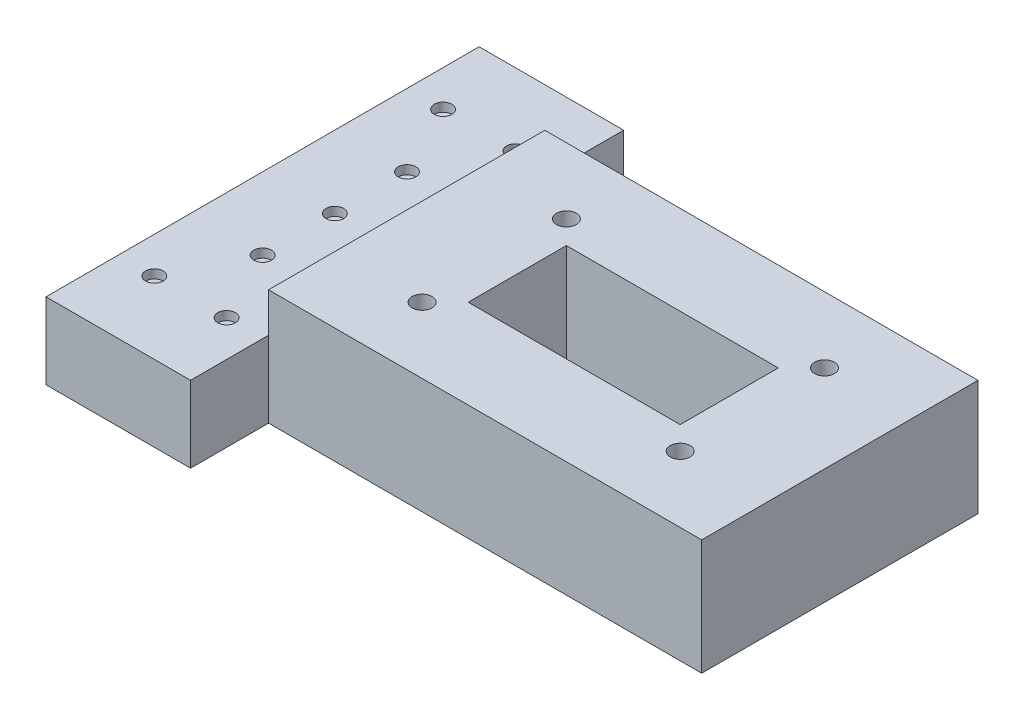
ISO-10303-21;
HEADER;
FILE_DESCRIPTION(('STEP AP214'),'2;1');
FILE_NAME('part.step','',(''),(''),'','','');
FILE_SCHEMA(('AUTOMOTIVE_DESIGN { 1 0 10303 214 1 1 1 1 }'));
ENDSEC;
DATA;
#1=APPLICATION_CONTEXT('core data for automotive mechanical design processes');
#2=APPLICATION_PROTOCOL_DEFINITION('international standard','automotive_design',2000,#1);
#3=PRODUCT_CONTEXT('',#1,'mechanical');
#4=PRODUCT('Part','Part','',(#3));
#5=PRODUCT_RELATED_PRODUCT_CATEGORY('part','',(#4));
#6=PRODUCT_DEFINITION_FORMATION('','',#4);
#7=PRODUCT_DEFINITION_CONTEXT('part definition',#1,'design');
#8=PRODUCT_DEFINITION('design','',#6,#7);
#9=PRODUCT_DEFINITION_SHAPE('','',#8);
#10=(LENGTH_UNIT() NAMED_UNIT(*) SI_UNIT(.MILLI.,.METRE.));
#11=(NAMED_UNIT(*) PLANE_ANGLE_UNIT() SI_UNIT($,.RADIAN.));
#12=(NAMED_UNIT(*) SI_UNIT($,.STERADIAN.) SOLID_ANGLE_UNIT());
#13=UNCERTAINTY_MEASURE_WITH_UNIT(LENGTH_MEASURE(1.E-05),#10,'distance_accuracy_value','');
#14=(GEOMETRIC_REPRESENTATION_CONTEXT(3) GLOBAL_UNCERTAINTY_ASSIGNED_CONTEXT((#13)) GLOBAL_UNIT_ASSIGNED_CONTEXT((#10,
#11,#12)) REPRESENTATION_CONTEXT('',''));
#15=CARTESIAN_POINT('',(0.,0.,0.));
#16=DIRECTION('',(0.,0.,1.));
#17=DIRECTION('',(1.,0.,0.));
#18=AXIS2_PLACEMENT_3D('',#15,#16,#17);
#19=CARTESIAN_POINT('',(-130.88,136.123620926388,0.));
#20=DIRECTION('',(1.,0.,0.));
#21=DIRECTION('',(0.,0.,-1.));
#22=AXIS2_PLACEMENT_3D('',#19,#20,#21);
#23=PLANE('',#22);
#24=DIRECTION('',(0.,0.,-1.));
#25=VECTOR('',#24,1.);
#26=CARTESIAN_POINT('',(-130.88,26.38,0.));
#27=LINE('',#26,#25);
#28=CARTESIAN_POINT('',(-130.88,26.38,10.));
#29=VERTEX_POINT('',#28);
#30=CARTESIAN_POINT('',(-130.88,26.38,-85.69));
#31=VERTEX_POINT('',#30);
#32=EDGE_CURVE('E11',#29,#31,#27,.T.);
#33=ORIENTED_EDGE('',*,*,#32,.F.);
#34=DIRECTION('',(0.,-1.,0.));
#35=VECTOR('',#34,1.);
#36=CARTESIAN_POINT('',(-130.88,136.123620926388,10.));
#37=LINE('',#36,#35);
#38=CARTESIAN_POINT('',(-130.88,40.,10.));
#39=VERTEX_POINT('',#38);
#40=EDGE_CURVE('E199',#39,#29,#37,.T.);
#41=ORIENTED_EDGE('',*,*,#40,.F.);
#42=DIRECTION('',(0.,0.,1.));
#43=VECTOR('',#42,1.);
#44=CARTESIAN_POINT('',(-130.88,40.,0.));
#45=LINE('',#44,#43);
#46=CARTESIAN_POINT('',(-130.88,40.,-85.69));
#47=VERTEX_POINT('',#46);
#48=EDGE_CURVE('E195',#47,#39,#45,.T.);
#49=ORIENTED_EDGE('',*,*,#48,.F.);
#50=DIRECTION('',(0.,-1.,0.));
#51=VECTOR('',#50,1.);
#52=CARTESIAN_POINT('',(-130.88,136.123620926388,-85.69));
#53=LINE('',#52,#51);
#54=EDGE_CURVE('E202',#47,#31,#53,.T.);
#55=ORIENTED_EDGE('',*,*,#54,.T.);
#56=EDGE_LOOP('',(#33,#41,#49,#55));
#57=FACE_BOUND('',#56,.T.);
#58=ADVANCED_FACE('F38',(#57),#23,.F.);
#59=CARTESIAN_POINT('',(-100.58,40.,-12.85));
#60=DIRECTION('',(0.,-1.,0.));
#61=DIRECTION('',(0.,0.,-1.));
#62=AXIS2_PLACEMENT_3D('',#59,#60,#61);
#63=CYLINDRICAL_SURFACE('',#62,3.43);
#64=CARTESIAN_POINT('',(-100.58,40.,-12.85));
#65=DIRECTION('',(0.,1.,0.));
#66=DIRECTION('',(0.,0.,1.));
#67=AXIS2_PLACEMENT_3D('',#64,#65,#66);
#68=CIRCLE('',#67,3.43);
#69=CARTESIAN_POINT('',(-100.58,40.,-9.41999999999997));
#70=VERTEX_POINT('',#69);
#71=EDGE_CURVE('E237',#70,#70,#68,.T.);
#72=ORIENTED_EDGE('',*,*,#71,.T.);
#73=EDGE_LOOP('',(#72));
#74=FACE_BOUND('',#73,.T.);
#75=CARTESIAN_POINT('',(-100.58,8.,-12.85));
#76=DIRECTION('',(0.,-1.,0.));
#77=DIRECTION('',(0.,0.,-1.));
#78=AXIS2_PLACEMENT_3D('',#75,#76,#77);
#79=CIRCLE('',#78,3.43);
#80=CARTESIAN_POINT('',(-100.58,8.,-16.28));
#81=VERTEX_POINT('',#80);
#82=EDGE_CURVE('E42',#81,#81,#79,.T.);
#83=ORIENTED_EDGE('',*,*,#82,.T.);
#84=EDGE_LOOP('',(#83));
#85=FACE_BOUND('',#84,.T.);
#86=ADVANCED_FACE('F287',(#74,#85),#63,.F.);
#87=CARTESIAN_POINT('',(-100.58,40.,-62.84));
#88=DIRECTION('',(0.,-1.,0.));
#89=DIRECTION('',(0.,0.,-1.));
#90=AXIS2_PLACEMENT_3D('',#87,#88,#89);
#91=CYLINDRICAL_SURFACE('',#90,3.43);
#92=CARTESIAN_POINT('',(-100.58,40.,-62.84));
#93=DIRECTION('',(0.,1.,0.));
#94=DIRECTION('',(0.,0.,1.));
#95=AXIS2_PLACEMENT_3D('',#92,#93,#94);
#96=CIRCLE('',#95,3.43);
#97=CARTESIAN_POINT('',(-100.58,40.,-59.41));
#98=VERTEX_POINT('',#97);
#99=EDGE_CURVE('E234',#98,#98,#96,.T.);
#100=ORIENTED_EDGE('',*,*,#99,.T.);
#101=EDGE_LOOP('',(#100));
#102=FACE_BOUND('',#101,.T.);
#103=CARTESIAN_POINT('',(-100.58,8.,-62.84));
#104=DIRECTION('',(0.,-1.,0.));
#105=DIRECTION('',(0.,0.,-1.));
#106=AXIS2_PLACEMENT_3D('',#103,#104,#105);
#107=CIRCLE('',#106,3.43);
#108=CARTESIAN_POINT('',(-100.58,8.,-66.27));
#109=VERTEX_POINT('',#108);
#110=EDGE_CURVE('E280',#109,#109,#107,.T.);
#111=ORIENTED_EDGE('',*,*,#110,.T.);
#112=EDGE_LOOP('',(#111));
#113=FACE_BOUND('',#112,.T.);
#114=ADVANCED_FACE('F344',(#102,#113),#91,.F.);
#115=CARTESIAN_POINT('',(-11.1800000000001,40.,-62.84));
#116=DIRECTION('',(0.,-1.,0.));
#117=DIRECTION('',(0.,0.,-1.));
#118=AXIS2_PLACEMENT_3D('',#115,#116,#117);
#119=CYLINDRICAL_SURFACE('',#118,3.43);
#120=CARTESIAN_POINT('',(-11.1800000000001,40.,-62.84));
#121=DIRECTION('',(0.,1.,0.));
#122=DIRECTION('',(0.,0.,1.));
#123=AXIS2_PLACEMENT_3D('',#120,#121,#122);
#124=CIRCLE('',#123,3.43);
#125=CARTESIAN_POINT('',(-11.1800000000001,40.,-59.41));
#126=VERTEX_POINT('',#125);
#127=EDGE_CURVE('E231',#126,#126,#124,.T.);
#128=ORIENTED_EDGE('',*,*,#127,.T.);
#129=EDGE_LOOP('',(#128));
#130=FACE_BOUND('',#129,.T.);
#131=CARTESIAN_POINT('',(-11.1800000000001,8.,-62.84));
#132=DIRECTION('',(0.,-1.,0.));
#133=DIRECTION('',(0.,0.,-1.));
#134=AXIS2_PLACEMENT_3D('',#131,#132,#133);
#135=CIRCLE('',#134,3.43);
#136=CARTESIAN_POINT('',(-11.1800000000001,8.,-66.27));
#137=VERTEX_POINT('',#136);
#138=EDGE_CURVE('E278',#137,#137,#135,.T.);
#139=ORIENTED_EDGE('',*,*,#138,.T.);
#140=EDGE_LOOP('',(#139));
#141=FACE_BOUND('',#140,.T.);
#142=ADVANCED_FACE('F375',(#130,#141),#119,.F.);
#143=CARTESIAN_POINT('',(-11.18,40.,-12.85));
#144=DIRECTION('',(0.,-1.,0.));
#145=DIRECTION('',(0.,0.,-1.));
#146=AXIS2_PLACEMENT_3D('',#143,#144,#145);
#147=CYLINDRICAL_SURFACE('',#146,3.43);
#148=CARTESIAN_POINT('',(-11.18,40.,-12.85));
#149=DIRECTION('',(0.,1.,0.));
#150=DIRECTION('',(0.,0.,1.));
#151=AXIS2_PLACEMENT_3D('',#148,#149,#150);
#152=CIRCLE('',#151,3.43);
#153=CARTESIAN_POINT('',(-11.18,40.,-9.41999999999998));
#154=VERTEX_POINT('',#153);
#155=EDGE_CURVE('E228',#154,#154,#152,.T.);
#156=ORIENTED_EDGE('',*,*,#155,.T.);
#157=EDGE_LOOP('',(#156));
#158=FACE_BOUND('',#157,.T.);
#159=CARTESIAN_POINT('',(-11.18,8.,-12.85));
#160=DIRECTION('',(0.,-1.,0.));
#161=DIRECTION('',(0.,0.,-1.));
#162=AXIS2_PLACEMENT_3D('',#159,#160,#161);
#163=CIRCLE('',#162,3.43);
#164=CARTESIAN_POINT('',(-11.18,8.,-16.28));
#165=VERTEX_POINT('',#164);
#166=EDGE_CURVE('E225',#165,#165,#163,.T.);
#167=ORIENTED_EDGE('',*,*,#166,.T.);
#168=EDGE_LOOP('',(#167));
#169=FACE_BOUND('',#168,.T.);
#170=ADVANCED_FACE('F372',(#158,#169),#147,.F.);
#171=CARTESIAN_POINT('',(0.,40.,0.));
#172=DIRECTION('',(0.,1.,0.));
#173=DIRECTION('',(0.,0.,1.));
#174=AXIS2_PLACEMENT_3D('',#171,#172,#173);
#175=PLANE('',#174);
#176=ORIENTED_EDGE('',*,*,#127,.F.);
#177=EDGE_LOOP('',(#176));
#178=FACE_BOUND('',#177,.T.);
#179=ORIENTED_EDGE('',*,*,#71,.F.);
#180=EDGE_LOOP('',(#179));
#181=FACE_BOUND('',#180,.T.);
#182=DIRECTION('',(-1.,0.,0.));
#183=VECTOR('',#182,1.);
#184=CARTESIAN_POINT('',(-121.76,40.,-85.69));
#185=LINE('',#184,#183);
#186=CARTESIAN_POINT('',(19.12,40.,-85.69));
#187=VERTEX_POINT('',#186);
#188=EDGE_CURVE('E47',#187,#47,#185,.T.);
#189=ORIENTED_EDGE('',*,*,#188,.T.);
#190=ORIENTED_EDGE('',*,*,#48,.T.);
#191=DIRECTION('',(1.,0.,0.));
#192=VECTOR('',#191,1.);
#193=CARTESIAN_POINT('',(-121.76,40.,10.));
#194=LINE('',#193,#192);
#195=CARTESIAN_POINT('',(19.12,40.,10.));
#196=VERTEX_POINT('',#195);
#197=EDGE_CURVE('E270',#39,#196,#194,.T.);
#198=ORIENTED_EDGE('',*,*,#197,.T.);
#199=DIRECTION('',(0.,0.,-1.));
#200=VECTOR('',#199,1.);
#201=CARTESIAN_POINT('',(19.12,40.,0.));
#202=LINE('',#201,#200);
#203=EDGE_CURVE('E186',#196,#187,#202,.T.);
#204=ORIENTED_EDGE('',*,*,#203,.T.);
#205=EDGE_LOOP('',(#189,#190,#198,#204));
#206=FACE_BOUND('',#205,.T.);
#207=DIRECTION('',(1.,0.,0.));
#208=VECTOR('',#207,1.);
#209=CARTESIAN_POINT('',(-92.58,40.,-20.85));
#210=LINE('',#209,#208);
#211=CARTESIAN_POINT('',(-92.58,40.,-20.85));
#212=VERTEX_POINT('',#211);
#213=CARTESIAN_POINT('',(-19.18,40.,-20.85));
#214=VERTEX_POINT('',#213);
#215=EDGE_CURVE('E243',#212,#214,#210,.T.);
#216=ORIENTED_EDGE('',*,*,#215,.F.);
#217=DIRECTION('',(0.,0.,1.));
#218=VECTOR('',#217,1.);
#219=CARTESIAN_POINT('',(-92.58,40.,-20.85));
#220=LINE('',#219,#218);
#221=CARTESIAN_POINT('',(-92.58,40.,-54.84));
#222=VERTEX_POINT('',#221);
#223=EDGE_CURVE('E241',#222,#212,#220,.T.);
#224=ORIENTED_EDGE('',*,*,#223,.F.);
#225=DIRECTION('',(-1.,0.,0.));
#226=VECTOR('',#225,1.);
#227=CARTESIAN_POINT('',(-92.58,40.,-54.84));
#228=LINE('',#227,#226);
#229=CARTESIAN_POINT('',(-19.18,40.,-54.84));
#230=VERTEX_POINT('',#229);
#231=EDGE_CURVE('E248',#230,#222,#228,.T.);
#232=ORIENTED_EDGE('',*,*,#231,.F.);
#233=DIRECTION('',(0.,0.,-1.));
#234=VECTOR('',#233,1.);
#235=CARTESIAN_POINT('',(-19.18,40.,-20.85));
#236=LINE('',#235,#234);
#237=EDGE_CURVE('E246',#214,#230,#236,.T.);
#238=ORIENTED_EDGE('',*,*,#237,.F.);
#239=EDGE_LOOP('',(#216,#224,#232,#238));
#240=FACE_BOUND('',#239,.T.);
#241=ORIENTED_EDGE('',*,*,#99,.F.);
#242=EDGE_LOOP('',(#241));
#243=FACE_BOUND('',#242,.T.);
#244=ORIENTED_EDGE('',*,*,#155,.F.);
#245=EDGE_LOOP('',(#244));
#246=FACE_BOUND('',#245,.T.);
#247=ADVANCED_FACE('F306',(#178,#181,#206,#240,#243,#246),#175,.T.);
#248=CARTESIAN_POINT('',(0.,0.,0.));
#249=DIRECTION('',(0.,1.,0.));
#250=DIRECTION('',(0.,0.,1.));
#251=AXIS2_PLACEMENT_3D('',#248,#249,#250);
#252=PLANE('',#251);
#253=CARTESIAN_POINT('',(-100.58,0.,-62.84));
#254=DIRECTION('',(0.,-1.,0.));
#255=DIRECTION('',(0.,0.,-1.));
#256=AXIS2_PLACEMENT_3D('',#253,#254,#255);
#257=CIRCLE('',#256,8.00000000000006);
#258=CARTESIAN_POINT('',(-100.58,0.,-70.8400000000001));
#259=VERTEX_POINT('',#258);
#260=EDGE_CURVE('E198',#259,#259,#257,.T.);
#261=ORIENTED_EDGE('',*,*,#260,.F.);
#262=EDGE_LOOP('',(#261));
#263=FACE_BOUND('',#262,.T.);
#264=CARTESIAN_POINT('',(-11.1800000000001,0.,-62.84));
#265=DIRECTION('',(0.,-1.,0.));
#266=DIRECTION('',(0.,0.,-1.));
#267=AXIS2_PLACEMENT_3D('',#264,#265,#266);
#268=CIRCLE('',#267,7.99999999999995);
#269=CARTESIAN_POINT('',(-11.1800000000001,0.,-70.84));
#270=VERTEX_POINT('',#269);
#271=EDGE_CURVE('E214',#270,#270,#268,.T.);
#272=ORIENTED_EDGE('',*,*,#271,.F.);
#273=EDGE_LOOP('',(#272));
#274=FACE_BOUND('',#273,.T.);
#275=CARTESIAN_POINT('',(-11.18,0.,-12.85));
#276=DIRECTION('',(0.,-1.,0.));
#277=DIRECTION('',(0.,0.,-1.));
#278=AXIS2_PLACEMENT_3D('',#275,#276,#277);
#279=CIRCLE('',#278,8.00000000000002);
#280=CARTESIAN_POINT('',(-11.18,0.,-20.85));
#281=VERTEX_POINT('',#280);
#282=EDGE_CURVE('E208',#281,#281,#279,.T.);
#283=ORIENTED_EDGE('',*,*,#282,.F.);
#284=EDGE_LOOP('',(#283));
#285=FACE_BOUND('',#284,.T.);
#286=CARTESIAN_POINT('',(-100.58,0.,-12.85));
#287=DIRECTION('',(0.,-1.,0.));
#288=DIRECTION('',(0.,0.,-1.));
#289=AXIS2_PLACEMENT_3D('',#286,#287,#288);
#290=CIRCLE('',#289,8.00000000000001);
#291=CARTESIAN_POINT('',(-100.58,0.,-20.85));
#292=VERTEX_POINT('',#291);
#293=EDGE_CURVE('E207',#292,#292,#290,.T.);
#294=ORIENTED_EDGE('',*,*,#293,.F.);
#295=EDGE_LOOP('',(#294));
#296=FACE_BOUND('',#295,.T.);
#297=DIRECTION('',(1.,0.,0.));
#298=VECTOR('',#297,1.);
#299=CARTESIAN_POINT('',(-121.76,0.,10.));
#300=LINE('',#299,#298);
#301=CARTESIAN_POINT('',(-130.88,0.,10.));
#302=VERTEX_POINT('',#301);
#303=CARTESIAN_POINT('',(19.12,0.,10.));
#304=VERTEX_POINT('',#303);
#305=EDGE_CURVE('E269',#302,#304,#300,.T.);
#306=ORIENTED_EDGE('',*,*,#305,.F.);
#307=DIRECTION('',(0.,0.,-1.));
#308=VECTOR('',#307,1.);
#309=CARTESIAN_POINT('',(-130.88,0.,0.));
#310=LINE('',#309,#308);
#311=CARTESIAN_POINT('',(-130.88,0.,37.02));
#312=VERTEX_POINT('',#311);
#313=EDGE_CURVE('E160',#312,#302,#310,.T.);
#314=ORIENTED_EDGE('',*,*,#313,.F.);
#315=DIRECTION('',(-1.,0.,0.));
#316=VECTOR('',#315,1.);
#317=CARTESIAN_POINT('',(0.,0.,37.02));
#318=LINE('',#317,#316);
#319=CARTESIAN_POINT('',(-180.93,0.,37.02));
#320=VERTEX_POINT('',#319);
#321=EDGE_CURVE('E170',#312,#320,#318,.T.);
#322=ORIENTED_EDGE('',*,*,#321,.T.);
#323=DIRECTION('',(0.,0.,-1.));
#324=VECTOR('',#323,1.);
#325=CARTESIAN_POINT('',(-180.93,0.,0.));
#326=LINE('',#325,#324);
#327=CARTESIAN_POINT('',(-180.93,0.,-112.98));
#328=VERTEX_POINT('',#327);
#329=EDGE_CURVE('E141',#320,#328,#326,.T.);
#330=ORIENTED_EDGE('',*,*,#329,.T.);
#331=DIRECTION('',(-1.,0.,0.));
#332=VECTOR('',#331,1.);
#333=CARTESIAN_POINT('',(0.,0.,-112.98));
#334=LINE('',#333,#332);
#335=CARTESIAN_POINT('',(-130.88,0.,-112.98));
#336=VERTEX_POINT('',#335);
#337=EDGE_CURVE('E174',#336,#328,#334,.T.);
#338=ORIENTED_EDGE('',*,*,#337,.F.);
#339=CARTESIAN_POINT('',(-130.88,0.,-85.69));
#340=VERTEX_POINT('',#339);
#341=EDGE_CURVE('E163',#340,#336,#310,.T.);
#342=ORIENTED_EDGE('',*,*,#341,.F.);
#343=DIRECTION('',(-1.,0.,0.));
#344=VECTOR('',#343,1.);
#345=CARTESIAN_POINT('',(-121.76,0.,-85.69));
#346=LINE('',#345,#344);
#347=CARTESIAN_POINT('',(19.12,0.,-85.69));
#348=VERTEX_POINT('',#347);
#349=EDGE_CURVE('E272',#348,#340,#346,.T.);
#350=ORIENTED_EDGE('',*,*,#349,.F.);
#351=DIRECTION('',(0.,0.,-1.));
#352=VECTOR('',#351,1.);
#353=CARTESIAN_POINT('',(19.12,0.,0.));
#354=LINE('',#353,#352);
#355=EDGE_CURVE('E183',#304,#348,#354,.T.);
#356=ORIENTED_EDGE('',*,*,#355,.F.);
#357=EDGE_LOOP('',(#306,#314,#322,#330,#338,#342,#350,#356));
#358=FACE_BOUND('',#357,.T.);
#359=DIRECTION('',(0.,0.,1.));
#360=VECTOR('',#359,1.);
#361=CARTESIAN_POINT('',(-92.58,0.,-20.85));
#362=LINE('',#361,#360);
#363=CARTESIAN_POINT('',(-92.58,0.,-54.84));
#364=VERTEX_POINT('',#363);
#365=CARTESIAN_POINT('',(-92.58,0.,-20.85));
#366=VERTEX_POINT('',#365);
#367=EDGE_CURVE('E240',#364,#366,#362,.T.);
#368=ORIENTED_EDGE('',*,*,#367,.T.);
#369=DIRECTION('',(1.,0.,0.));
#370=VECTOR('',#369,1.);
#371=CARTESIAN_POINT('',(-92.58,0.,-20.85));
#372=LINE('',#371,#370);
#373=CARTESIAN_POINT('',(-19.18,0.,-20.85));
#374=VERTEX_POINT('',#373);
#375=EDGE_CURVE('E253',#366,#374,#372,.T.);
#376=ORIENTED_EDGE('',*,*,#375,.T.);
#377=DIRECTION('',(0.,0.,-1.));
#378=VECTOR('',#377,1.);
#379=CARTESIAN_POINT('',(-19.18,0.,-20.85));
#380=LINE('',#379,#378);
#381=CARTESIAN_POINT('',(-19.18,0.,-54.84));
#382=VERTEX_POINT('',#381);
#383=EDGE_CURVE('E256',#374,#382,#380,.T.);
#384=ORIENTED_EDGE('',*,*,#383,.T.);
#385=DIRECTION('',(-1.,0.,0.));
#386=VECTOR('',#385,1.);
#387=CARTESIAN_POINT('',(-92.58,0.,-54.84));
#388=LINE('',#387,#386);
#389=EDGE_CURVE('E244',#382,#364,#388,.T.);
#390=ORIENTED_EDGE('',*,*,#389,.T.);
#391=EDGE_LOOP('',(#368,#376,#384,#390));
#392=FACE_BOUND('',#391,.T.);
#393=ADVANCED_FACE('F303',(#263,#274,#285,#296,#358,#392),#252,.F.);
#394=CARTESIAN_POINT('',(-121.76,40.,10.));
#395=DIRECTION('',(0.,0.,-1.));
#396=DIRECTION('',(-1.,0.,0.));
#397=AXIS2_PLACEMENT_3D('',#394,#395,#396);
#398=PLANE('',#397);
#399=ORIENTED_EDGE('',*,*,#305,.T.);
#400=DIRECTION('',(0.,-1.,0.));
#401=VECTOR('',#400,1.);
#402=CARTESIAN_POINT('',(19.12,136.123620926388,10.));
#403=LINE('',#402,#401);
#404=EDGE_CURVE('E187',#196,#304,#403,.T.);
#405=ORIENTED_EDGE('',*,*,#404,.F.);
#406=ORIENTED_EDGE('',*,*,#197,.F.);
#407=ORIENTED_EDGE('',*,*,#40,.T.);
#408=EDGE_CURVE('E201',#29,#302,#37,.T.);
#409=ORIENTED_EDGE('',*,*,#408,.T.);
#410=EDGE_LOOP('',(#399,#405,#406,#407,#409));
#411=FACE_BOUND('',#410,.T.);
#412=ADVANCED_FACE('F40',(#411),#398,.F.);
#413=CARTESIAN_POINT('',(-121.76,40.,-85.69));
#414=DIRECTION('',(0.,0.,1.));
#415=DIRECTION('',(1.,0.,0.));
#416=AXIS2_PLACEMENT_3D('',#413,#414,#415);
#417=PLANE('',#416);
#418=ORIENTED_EDGE('',*,*,#349,.T.);
#419=EDGE_CURVE('E190',#31,#340,#53,.T.);
#420=ORIENTED_EDGE('',*,*,#419,.F.);
#421=ORIENTED_EDGE('',*,*,#54,.F.);
#422=ORIENTED_EDGE('',*,*,#188,.F.);
#423=DIRECTION('',(0.,-1.,0.));
#424=VECTOR('',#423,1.);
#425=CARTESIAN_POINT('',(19.12,136.123620926388,-85.69));
#426=LINE('',#425,#424);
#427=EDGE_CURVE('E178',#187,#348,#426,.T.);
#428=ORIENTED_EDGE('',*,*,#427,.T.);
#429=EDGE_LOOP('',(#418,#420,#421,#422,#428));
#430=FACE_BOUND('',#429,.T.);
#431=ADVANCED_FACE('F402',(#430),#417,.F.);
#432=CARTESIAN_POINT('',(-92.58,40.,-20.85));
#433=DIRECTION('',(1.,0.,0.));
#434=DIRECTION('',(0.,0.,-1.));
#435=AXIS2_PLACEMENT_3D('',#432,#433,#434);
#436=PLANE('',#435);
#437=ORIENTED_EDGE('',*,*,#367,.F.);
#438=DIRECTION('',(0.,-1.,0.));
#439=VECTOR('',#438,1.);
#440=CARTESIAN_POINT('',(-92.58,40.,-54.84));
#441=LINE('',#440,#439);
#442=EDGE_CURVE('E250',#222,#364,#441,.T.);
#443=ORIENTED_EDGE('',*,*,#442,.F.);
#444=ORIENTED_EDGE('',*,*,#223,.T.);
#445=DIRECTION('',(0.,-1.,0.));
#446=VECTOR('',#445,1.);
#447=CARTESIAN_POINT('',(-92.58,40.,-20.85));
#448=LINE('',#447,#446);
#449=EDGE_CURVE('E266',#212,#366,#448,.T.);
#450=ORIENTED_EDGE('',*,*,#449,.T.);
#451=EDGE_LOOP('',(#437,#443,#444,#450));
#452=FACE_BOUND('',#451,.T.);
#453=ADVANCED_FACE('F315',(#452),#436,.T.);
#454=CARTESIAN_POINT('',(-92.58,40.,-20.85));
#455=DIRECTION('',(0.,0.,-1.));
#456=DIRECTION('',(-1.,0.,0.));
#457=AXIS2_PLACEMENT_3D('',#454,#455,#456);
#458=PLANE('',#457);
#459=ORIENTED_EDGE('',*,*,#375,.F.);
#460=ORIENTED_EDGE('',*,*,#449,.F.);
#461=ORIENTED_EDGE('',*,*,#215,.T.);
#462=DIRECTION('',(0.,-1.,0.));
#463=VECTOR('',#462,1.);
#464=CARTESIAN_POINT('',(-19.18,40.,-20.85));
#465=LINE('',#464,#463);
#466=EDGE_CURVE('E264',#214,#374,#465,.T.);
#467=ORIENTED_EDGE('',*,*,#466,.T.);
#468=EDGE_LOOP('',(#459,#460,#461,#467));
#469=FACE_BOUND('',#468,.T.);
#470=ADVANCED_FACE('F325',(#469),#458,.T.);
#471=CARTESIAN_POINT('',(-19.18,40.,-20.85));
#472=DIRECTION('',(-1.,0.,0.));
#473=DIRECTION('',(0.,0.,1.));
#474=AXIS2_PLACEMENT_3D('',#471,#472,#473);
#475=PLANE('',#474);
#476=ORIENTED_EDGE('',*,*,#383,.F.);
#477=ORIENTED_EDGE('',*,*,#466,.F.);
#478=ORIENTED_EDGE('',*,*,#237,.T.);
#479=DIRECTION('',(0.,-1.,0.));
#480=VECTOR('',#479,1.);
#481=CARTESIAN_POINT('',(-19.18,40.,-54.84));
#482=LINE('',#481,#480);
#483=EDGE_CURVE('E63',#230,#382,#482,.T.);
#484=ORIENTED_EDGE('',*,*,#483,.T.);
#485=EDGE_LOOP('',(#476,#477,#478,#484));
#486=FACE_BOUND('',#485,.T.);
#487=ADVANCED_FACE('F329',(#486),#475,.T.);
#488=CARTESIAN_POINT('',(-92.58,40.,-54.84));
#489=DIRECTION('',(0.,0.,1.));
#490=DIRECTION('',(1.,0.,0.));
#491=AXIS2_PLACEMENT_3D('',#488,#489,#490);
#492=PLANE('',#491);
#493=ORIENTED_EDGE('',*,*,#389,.F.);
#494=ORIENTED_EDGE('',*,*,#483,.F.);
#495=ORIENTED_EDGE('',*,*,#231,.T.);
#496=ORIENTED_EDGE('',*,*,#442,.T.);
#497=EDGE_LOOP('',(#493,#494,#495,#496));
#498=FACE_BOUND('',#497,.T.);
#499=ADVANCED_FACE('F318',(#498),#492,.T.);
#500=CARTESIAN_POINT('',(-11.18,8.,-12.85));
#501=DIRECTION('',(0.,-1.,0.));
#502=DIRECTION('',(0.,0.,-1.));
#503=AXIS2_PLACEMENT_3D('',#500,#501,#502);
#504=CYLINDRICAL_SURFACE('',#503,8.00000000000002);
#505=CARTESIAN_POINT('',(-11.18,8.,-12.85));
#506=DIRECTION('',(0.,-1.,0.));
#507=DIRECTION('',(0.,0.,-1.));
#508=AXIS2_PLACEMENT_3D('',#505,#506,#507);
#509=CIRCLE('',#508,8.00000000000002);
#510=CARTESIAN_POINT('',(-11.18,8.,-20.85));
#511=VERTEX_POINT('',#510);
#512=EDGE_CURVE('E204',#511,#511,#509,.T.);
#513=ORIENTED_EDGE('',*,*,#512,.F.);
#514=EDGE_LOOP('',(#513));
#515=FACE_BOUND('',#514,.T.);
#516=ORIENTED_EDGE('',*,*,#282,.T.);
#517=EDGE_LOOP('',(#516));
#518=FACE_BOUND('',#517,.T.);
#519=ADVANCED_FACE('F336',(#515,#518),#504,.F.);
#520=CARTESIAN_POINT('',(-11.18,8.,-12.85));
#521=DIRECTION('',(0.,-1.,0.));
#522=DIRECTION('',(0.,0.,-1.));
#523=AXIS2_PLACEMENT_3D('',#520,#521,#522);
#524=PLANE('',#523);
#525=ORIENTED_EDGE('',*,*,#166,.F.);
#526=EDGE_LOOP('',(#525));
#527=FACE_BOUND('',#526,.T.);
#528=ORIENTED_EDGE('',*,*,#512,.T.);
#529=EDGE_LOOP('',(#528));
#530=FACE_BOUND('',#529,.T.);
#531=ADVANCED_FACE('F350',(#527,#530),#524,.T.);
#532=CARTESIAN_POINT('',(-11.1800000000001,8.,-62.84));
#533=DIRECTION('',(0.,-1.,0.));
#534=DIRECTION('',(0.,0.,-1.));
#535=AXIS2_PLACEMENT_3D('',#532,#533,#534);
#536=CYLINDRICAL_SURFACE('',#535,7.99999999999995);
#537=CARTESIAN_POINT('',(-11.1800000000001,8.,-62.84));
#538=DIRECTION('',(0.,-1.,0.));
#539=DIRECTION('',(0.,0.,-1.));
#540=AXIS2_PLACEMENT_3D('',#537,#538,#539);
#541=CIRCLE('',#540,7.99999999999995);
#542=CARTESIAN_POINT('',(-11.1800000000001,8.,-70.84));
#543=VERTEX_POINT('',#542);
#544=EDGE_CURVE('E211',#543,#543,#541,.T.);
#545=ORIENTED_EDGE('',*,*,#544,.F.);
#546=EDGE_LOOP('',(#545));
#547=FACE_BOUND('',#546,.T.);
#548=ORIENTED_EDGE('',*,*,#271,.T.);
#549=EDGE_LOOP('',(#548));
#550=FACE_BOUND('',#549,.T.);
#551=ADVANCED_FACE('F353',(#547,#550),#536,.F.);
#552=CARTESIAN_POINT('',(-11.1800000000001,8.,-62.84));
#553=DIRECTION('',(0.,-1.,0.));
#554=DIRECTION('',(0.,0.,-1.));
#555=AXIS2_PLACEMENT_3D('',#552,#553,#554);
#556=PLANE('',#555);
#557=ORIENTED_EDGE('',*,*,#138,.F.);
#558=EDGE_LOOP('',(#557));
#559=FACE_BOUND('',#558,.T.);
#560=ORIENTED_EDGE('',*,*,#544,.T.);
#561=EDGE_LOOP('',(#560));
#562=FACE_BOUND('',#561,.T.);
#563=ADVANCED_FACE('F358',(#559,#562),#556,.T.);
#564=CARTESIAN_POINT('',(-100.58,8.,-62.84));
#565=DIRECTION('',(0.,-1.,0.));
#566=DIRECTION('',(0.,0.,-1.));
#567=AXIS2_PLACEMENT_3D('',#564,#565,#566);
#568=CYLINDRICAL_SURFACE('',#567,8.00000000000006);
#569=CARTESIAN_POINT('',(-100.58,8.,-62.84));
#570=DIRECTION('',(0.,-1.,0.));
#571=DIRECTION('',(0.,0.,-1.));
#572=AXIS2_PLACEMENT_3D('',#569,#570,#571);
#573=CIRCLE('',#572,8.00000000000006);
#574=CARTESIAN_POINT('',(-100.58,8.,-70.8400000000001));
#575=VERTEX_POINT('',#574);
#576=EDGE_CURVE('E217',#575,#575,#573,.T.);
#577=ORIENTED_EDGE('',*,*,#576,.F.);
#578=EDGE_LOOP('',(#577));
#579=FACE_BOUND('',#578,.T.);
#580=ORIENTED_EDGE('',*,*,#260,.T.);
#581=EDGE_LOOP('',(#580));
#582=FACE_BOUND('',#581,.T.);
#583=ADVANCED_FACE('F361',(#579,#582),#568,.F.);
#584=CARTESIAN_POINT('',(-100.58,8.,-62.84));
#585=DIRECTION('',(0.,-1.,0.));
#586=DIRECTION('',(0.,0.,-1.));
#587=AXIS2_PLACEMENT_3D('',#584,#585,#586);
#588=PLANE('',#587);
#589=ORIENTED_EDGE('',*,*,#110,.F.);
#590=EDGE_LOOP('',(#589));
#591=FACE_BOUND('',#590,.T.);
#592=ORIENTED_EDGE('',*,*,#576,.T.);
#593=EDGE_LOOP('',(#592));
#594=FACE_BOUND('',#593,.T.);
#595=ADVANCED_FACE('F299',(#591,#594),#588,.T.);
#596=CARTESIAN_POINT('',(-100.58,8.,-12.85));
#597=DIRECTION('',(0.,-1.,0.));
#598=DIRECTION('',(0.,0.,-1.));
#599=AXIS2_PLACEMENT_3D('',#596,#597,#598);
#600=CYLINDRICAL_SURFACE('',#599,8.00000000000001);
#601=CARTESIAN_POINT('',(-100.58,8.,-12.85));
#602=DIRECTION('',(0.,-1.,0.));
#603=DIRECTION('',(0.,0.,-1.));
#604=AXIS2_PLACEMENT_3D('',#601,#602,#603);
#605=CIRCLE('',#604,8.00000000000001);
#606=CARTESIAN_POINT('',(-100.58,8.,-20.85));
#607=VERTEX_POINT('',#606);
#608=EDGE_CURVE('E222',#607,#607,#605,.T.);
#609=ORIENTED_EDGE('',*,*,#608,.F.);
#610=EDGE_LOOP('',(#609));
#611=FACE_BOUND('',#610,.T.);
#612=ORIENTED_EDGE('',*,*,#293,.T.);
#613=EDGE_LOOP('',(#612));
#614=FACE_BOUND('',#613,.T.);
#615=ADVANCED_FACE('F293',(#611,#614),#600,.F.);
#616=CARTESIAN_POINT('',(-100.58,8.,-12.85));
#617=DIRECTION('',(0.,-1.,0.));
#618=DIRECTION('',(0.,0.,-1.));
#619=AXIS2_PLACEMENT_3D('',#616,#617,#618);
#620=PLANE('',#619);
#621=ORIENTED_EDGE('',*,*,#82,.F.);
#622=EDGE_LOOP('',(#621));
#623=FACE_BOUND('',#622,.T.);
#624=ORIENTED_EDGE('',*,*,#608,.T.);
#625=EDGE_LOOP('',(#624));
#626=FACE_BOUND('',#625,.T.);
#627=ADVANCED_FACE('F289',(#623,#626),#620,.T.);
#628=CARTESIAN_POINT('',(19.12,136.123620926388,0.));
#629=DIRECTION('',(-1.,0.,0.));
#630=DIRECTION('',(0.,0.,1.));
#631=AXIS2_PLACEMENT_3D('',#628,#629,#630);
#632=PLANE('',#631);
#633=ORIENTED_EDGE('',*,*,#203,.F.);
#634=ORIENTED_EDGE('',*,*,#404,.T.);
#635=ORIENTED_EDGE('',*,*,#355,.T.);
#636=ORIENTED_EDGE('',*,*,#427,.F.);
#637=EDGE_LOOP('',(#633,#634,#635,#636));
#638=FACE_BOUND('',#637,.T.);
#639=ADVANCED_FACE('F292',(#638),#632,.F.);
#640=CARTESIAN_POINT('',(-130.88,26.38,0.));
#641=DIRECTION('',(-1.,0.,0.));
#642=DIRECTION('',(0.,0.,1.));
#643=AXIS2_PLACEMENT_3D('',#640,#641,#642);
#644=PLANE('',#643);
#645=CARTESIAN_POINT('',(-130.88,26.38,-112.98));
#646=VERTEX_POINT('',#645);
#647=EDGE_CURVE('E50',#31,#646,#27,.T.);
#648=ORIENTED_EDGE('',*,*,#647,.F.);
#649=ORIENTED_EDGE('',*,*,#419,.T.);
#650=ORIENTED_EDGE('',*,*,#341,.T.);
#651=DIRECTION('',(0.,-1.,0.));
#652=VECTOR('',#651,1.);
#653=CARTESIAN_POINT('',(-130.88,26.38,-112.98));
#654=LINE('',#653,#652);
#655=EDGE_CURVE('E179',#646,#336,#654,.T.);
#656=ORIENTED_EDGE('',*,*,#655,.F.);
#657=EDGE_LOOP('',(#648,#649,#650,#656));
#658=FACE_BOUND('',#657,.T.);
#659=ADVANCED_FACE('F417',(#658),#644,.F.);
#660=CARTESIAN_POINT('',(0.,26.38,37.02));
#661=DIRECTION('',(0.,0.,1.));
#662=DIRECTION('',(1.,0.,0.));
#663=AXIS2_PLACEMENT_3D('',#660,#661,#662);
#664=PLANE('',#663);
#665=ORIENTED_EDGE('',*,*,#321,.F.);
#666=DIRECTION('',(0.,-1.,0.));
#667=VECTOR('',#666,1.);
#668=CARTESIAN_POINT('',(-130.88,26.38,37.02));
#669=LINE('',#668,#667);
#670=CARTESIAN_POINT('',(-130.88,26.38,37.02));
#671=VERTEX_POINT('',#670);
#672=EDGE_CURVE('E158',#671,#312,#669,.T.);
#673=ORIENTED_EDGE('',*,*,#672,.F.);
#674=DIRECTION('',(-1.,0.,0.));
#675=VECTOR('',#674,1.);
#676=CARTESIAN_POINT('',(0.,26.38,37.02));
#677=LINE('',#676,#675);
#678=CARTESIAN_POINT('',(-180.93,26.38,37.02));
#679=VERTEX_POINT('',#678);
#680=EDGE_CURVE('E152',#671,#679,#677,.T.);
#681=ORIENTED_EDGE('',*,*,#680,.T.);
#682=DIRECTION('',(0.,-1.,0.));
#683=VECTOR('',#682,1.);
#684=CARTESIAN_POINT('',(-180.93,26.38,37.02));
#685=LINE('',#684,#683);
#686=EDGE_CURVE('E136',#679,#320,#685,.T.);
#687=ORIENTED_EDGE('',*,*,#686,.T.);
#688=EDGE_LOOP('',(#665,#673,#681,#687));
#689=FACE_BOUND('',#688,.T.);
#690=ADVANCED_FACE('F157',(#689),#664,.T.);
#691=ORIENTED_EDGE('',*,*,#408,.F.);
#692=EDGE_CURVE('E49',#671,#29,#27,.T.);
#693=ORIENTED_EDGE('',*,*,#692,.F.);
#694=ORIENTED_EDGE('',*,*,#672,.T.);
#695=ORIENTED_EDGE('',*,*,#313,.T.);
#696=EDGE_LOOP('',(#691,#693,#694,#695));
#697=FACE_BOUND('',#696,.T.);
#698=ADVANCED_FACE('F423',(#697),#644,.F.);
#699=CARTESIAN_POINT('',(0.,26.38,-112.98));
#700=DIRECTION('',(0.,0.,1.));
#701=DIRECTION('',(1.,0.,0.));
#702=AXIS2_PLACEMENT_3D('',#699,#700,#701);
#703=PLANE('',#702);
#704=ORIENTED_EDGE('',*,*,#337,.T.);
#705=DIRECTION('',(0.,-1.,0.));
#706=VECTOR('',#705,1.);
#707=CARTESIAN_POINT('',(-180.93,26.38,-112.98));
#708=LINE('',#707,#706);
#709=CARTESIAN_POINT('',(-180.93,26.38,-112.98));
#710=VERTEX_POINT('',#709);
#711=EDGE_CURVE('E146',#710,#328,#708,.T.);
#712=ORIENTED_EDGE('',*,*,#711,.F.);
#713=DIRECTION('',(-1.,0.,0.));
#714=VECTOR('',#713,1.);
#715=CARTESIAN_POINT('',(0.,26.38,-112.98));
#716=LINE('',#715,#714);
#717=EDGE_CURVE('E154',#646,#710,#716,.T.);
#718=ORIENTED_EDGE('',*,*,#717,.F.);
#719=ORIENTED_EDGE('',*,*,#655,.T.);
#720=EDGE_LOOP('',(#704,#712,#718,#719));
#721=FACE_BOUND('',#720,.T.);
#722=ADVANCED_FACE('F421',(#721),#703,.F.);
#723=CARTESIAN_POINT('',(-180.93,26.38,0.));
#724=DIRECTION('',(-1.,0.,0.));
#725=DIRECTION('',(0.,0.,1.));
#726=AXIS2_PLACEMENT_3D('',#723,#724,#725);
#727=PLANE('',#726);
#728=ORIENTED_EDGE('',*,*,#329,.F.);
#729=ORIENTED_EDGE('',*,*,#686,.F.);
#730=DIRECTION('',(0.,0.,-1.));
#731=VECTOR('',#730,1.);
#732=CARTESIAN_POINT('',(-180.93,26.38,0.));
#733=LINE('',#732,#731);
#734=EDGE_CURVE('E139',#679,#710,#733,.T.);
#735=ORIENTED_EDGE('',*,*,#734,.T.);
#736=ORIENTED_EDGE('',*,*,#711,.T.);
#737=EDGE_LOOP('',(#728,#729,#735,#736));
#738=FACE_BOUND('',#737,.T.);
#739=ADVANCED_FACE('F138',(#738),#727,.T.);
#740=CARTESIAN_POINT('',(0.,26.38,0.));
#741=DIRECTION('',(0.,-1.,0.));
#742=DIRECTION('',(0.,0.,-1.));
#743=AXIS2_PLACEMENT_3D('',#740,#741,#742);
#744=PLANE('',#743);
#745=CARTESIAN_POINT('',(-168.4175,26.38,12.02));
#746=DIRECTION('',(0.,1.,0.));
#747=DIRECTION('',(0.,0.,1.));
#748=AXIS2_PLACEMENT_3D('',#745,#746,#747);
#749=CIRCLE('',#748,3.04999999999999);
#750=CARTESIAN_POINT('',(-168.4175,26.38,15.07));
#751=VERTEX_POINT('',#750);
#752=EDGE_CURVE('E765',#751,#751,#749,.T.);
#753=ORIENTED_EDGE('',*,*,#752,.F.);
#754=EDGE_LOOP('',(#753));
#755=FACE_BOUND('',#754,.T.);
#756=CARTESIAN_POINT('',(-143.3925,26.38,12.02));
#757=DIRECTION('',(0.,1.,0.));
#758=DIRECTION('',(0.,0.,1.));
#759=AXIS2_PLACEMENT_3D('',#756,#757,#758);
#760=CIRCLE('',#759,3.04999999999999);
#761=CARTESIAN_POINT('',(-143.3925,26.38,15.07));
#762=VERTEX_POINT('',#761);
#763=EDGE_CURVE('E803',#762,#762,#760,.T.);
#764=ORIENTED_EDGE('',*,*,#763,.F.);
#765=EDGE_LOOP('',(#764));
#766=FACE_BOUND('',#765,.T.);
#767=CARTESIAN_POINT('',(-155.905,26.38,-12.98));
#768=DIRECTION('',(0.,1.,0.));
#769=DIRECTION('',(0.,0.,1.));
#770=AXIS2_PLACEMENT_3D('',#767,#768,#769);
#771=CIRCLE('',#770,3.04999999999999);
#772=CARTESIAN_POINT('',(-155.905,26.38,-9.93000000000003));
#773=VERTEX_POINT('',#772);
#774=EDGE_CURVE('E797',#773,#773,#771,.T.);
#775=ORIENTED_EDGE('',*,*,#774,.F.);
#776=EDGE_LOOP('',(#775));
#777=FACE_BOUND('',#776,.T.);
#778=CARTESIAN_POINT('',(-155.905,26.38,-37.98));
#779=DIRECTION('',(0.,1.,0.));
#780=DIRECTION('',(0.,0.,1.));
#781=AXIS2_PLACEMENT_3D('',#778,#779,#780);
#782=CIRCLE('',#781,3.04999999999999);
#783=CARTESIAN_POINT('',(-155.905,26.38,-34.93));
#784=VERTEX_POINT('',#783);
#785=EDGE_CURVE('E791',#784,#784,#782,.T.);
#786=ORIENTED_EDGE('',*,*,#785,.F.);
#787=EDGE_LOOP('',(#786));
#788=FACE_BOUND('',#787,.T.);
#789=CARTESIAN_POINT('',(-155.905,26.38,-62.98));
#790=DIRECTION('',(0.,1.,0.));
#791=DIRECTION('',(0.,0.,1.));
#792=AXIS2_PLACEMENT_3D('',#789,#790,#791);
#793=CIRCLE('',#792,3.04999999999999);
#794=CARTESIAN_POINT('',(-155.905,26.38,-59.93));
#795=VERTEX_POINT('',#794);
#796=EDGE_CURVE('E783',#795,#795,#793,.T.);
#797=ORIENTED_EDGE('',*,*,#796,.F.);
#798=EDGE_LOOP('',(#797));
#799=FACE_BOUND('',#798,.T.);
#800=CARTESIAN_POINT('',(-143.3925,26.38,-87.98));
#801=DIRECTION('',(0.,1.,0.));
#802=DIRECTION('',(0.,0.,1.));
#803=AXIS2_PLACEMENT_3D('',#800,#801,#802);
#804=CIRCLE('',#803,3.04999999999999);
#805=CARTESIAN_POINT('',(-143.3925,26.38,-84.93));
#806=VERTEX_POINT('',#805);
#807=EDGE_CURVE('E774',#806,#806,#804,.T.);
#808=ORIENTED_EDGE('',*,*,#807,.F.);
#809=EDGE_LOOP('',(#808));
#810=FACE_BOUND('',#809,.T.);
#811=CARTESIAN_POINT('',(-168.4175,26.38,-87.98));
#812=DIRECTION('',(0.,1.,0.));
#813=DIRECTION('',(0.,0.,1.));
#814=AXIS2_PLACEMENT_3D('',#811,#812,#813);
#815=CIRCLE('',#814,3.04999999999999);
#816=CARTESIAN_POINT('',(-168.4175,26.38,-84.93));
#817=VERTEX_POINT('',#816);
#818=EDGE_CURVE('E166',#817,#817,#815,.T.);
#819=ORIENTED_EDGE('',*,*,#818,.F.);
#820=EDGE_LOOP('',(#819));
#821=FACE_BOUND('',#820,.T.);
#822=ORIENTED_EDGE('',*,*,#680,.F.);
#823=ORIENTED_EDGE('',*,*,#692,.T.);
#824=ORIENTED_EDGE('',*,*,#32,.T.);
#825=ORIENTED_EDGE('',*,*,#647,.T.);
#826=ORIENTED_EDGE('',*,*,#717,.T.);
#827=ORIENTED_EDGE('',*,*,#734,.F.);
#828=EDGE_LOOP('',(#822,#823,#824,#825,#826,#827));
#829=FACE_BOUND('',#828,.T.);
#830=ADVANCED_FACE('F150',(#755,#766,#777,#788,#799,#810,#821,#829),#744,.F.);
#831=CARTESIAN_POINT('',(-168.4175,23.33,-87.98));
#832=DIRECTION('',(0.,1.,0.));
#833=DIRECTION('',(0.,0.,1.));
#834=AXIS2_PLACEMENT_3D('',#831,#832,#833);
#835=CYLINDRICAL_SURFACE('',#834,3.04999999999999);
#836=CARTESIAN_POINT('',(-168.4175,23.33,-87.98));
#837=DIRECTION('',(0.,1.,0.));
#838=DIRECTION('',(0.,0.,1.));
#839=AXIS2_PLACEMENT_3D('',#836,#837,#838);
#840=CIRCLE('',#839,3.04999999999999);
#841=CARTESIAN_POINT('',(-168.4175,23.33,-84.93));
#842=VERTEX_POINT('',#841);
#843=EDGE_CURVE('E172',#842,#842,#840,.T.);
#844=ORIENTED_EDGE('',*,*,#843,.F.);
#845=EDGE_LOOP('',(#844));
#846=FACE_BOUND('',#845,.T.);
#847=ORIENTED_EDGE('',*,*,#818,.T.);
#848=EDGE_LOOP('',(#847));
#849=FACE_BOUND('',#848,.T.);
#850=ADVANCED_FACE('F619',(#846,#849),#835,.F.);
#851=CARTESIAN_POINT('',(-168.4175,23.33,-87.98));
#852=DIRECTION('',(0.,1.,0.));
#853=DIRECTION('',(0.,0.,1.));
#854=AXIS2_PLACEMENT_3D('',#851,#852,#853);
#855=PLANE('',#854);
#856=ORIENTED_EDGE('',*,*,#843,.T.);
#857=EDGE_LOOP('',(#856));
#858=FACE_BOUND('',#857,.T.);
#859=ADVANCED_FACE('F628',(#858),#855,.T.);
#860=CARTESIAN_POINT('',(-143.3925,23.33,-87.98));
#861=DIRECTION('',(0.,1.,0.));
#862=DIRECTION('',(0.,0.,1.));
#863=AXIS2_PLACEMENT_3D('',#860,#861,#862);
#864=CYLINDRICAL_SURFACE('',#863,3.04999999999999);
#865=CARTESIAN_POINT('',(-143.3925,23.33,-87.98));
#866=DIRECTION('',(0.,1.,0.));
#867=DIRECTION('',(0.,0.,1.));
#868=AXIS2_PLACEMENT_3D('',#865,#866,#867);
#869=CIRCLE('',#868,3.04999999999999);
#870=CARTESIAN_POINT('',(-143.3925,23.33,-84.93));
#871=VERTEX_POINT('',#870);
#872=EDGE_CURVE('E778',#871,#871,#869,.T.);
#873=ORIENTED_EDGE('',*,*,#872,.F.);
#874=EDGE_LOOP('',(#873));
#875=FACE_BOUND('',#874,.T.);
#876=ORIENTED_EDGE('',*,*,#807,.T.);
#877=EDGE_LOOP('',(#876));
#878=FACE_BOUND('',#877,.T.);
#879=ADVANCED_FACE('F638',(#875,#878),#864,.F.);
#880=CARTESIAN_POINT('',(-143.3925,23.33,-87.98));
#881=DIRECTION('',(0.,1.,0.));
#882=DIRECTION('',(0.,0.,1.));
#883=AXIS2_PLACEMENT_3D('',#880,#881,#882);
#884=PLANE('',#883);
#885=ORIENTED_EDGE('',*,*,#872,.T.);
#886=EDGE_LOOP('',(#885));
#887=FACE_BOUND('',#886,.T.);
#888=ADVANCED_FACE('F648',(#887),#884,.T.);
#889=CARTESIAN_POINT('',(-155.905,23.33,-62.98));
#890=DIRECTION('',(0.,1.,0.));
#891=DIRECTION('',(0.,0.,1.));
#892=AXIS2_PLACEMENT_3D('',#889,#890,#891);
#893=CYLINDRICAL_SURFACE('',#892,3.04999999999999);
#894=CARTESIAN_POINT('',(-155.905,23.33,-62.98));
#895=DIRECTION('',(0.,1.,0.));
#896=DIRECTION('',(0.,0.,1.));
#897=AXIS2_PLACEMENT_3D('',#894,#895,#896);
#898=CIRCLE('',#897,3.04999999999999);
#899=CARTESIAN_POINT('',(-155.905,23.33,-59.93));
#900=VERTEX_POINT('',#899);
#901=EDGE_CURVE('E788',#900,#900,#898,.T.);
#902=ORIENTED_EDGE('',*,*,#901,.F.);
#903=EDGE_LOOP('',(#902));
#904=FACE_BOUND('',#903,.T.);
#905=ORIENTED_EDGE('',*,*,#796,.T.);
#906=EDGE_LOOP('',(#905));
#907=FACE_BOUND('',#906,.T.);
#908=ADVANCED_FACE('F658',(#904,#907),#893,.F.);
#909=CARTESIAN_POINT('',(-155.905,23.33,-62.98));
#910=DIRECTION('',(0.,1.,0.));
#911=DIRECTION('',(0.,0.,1.));
#912=AXIS2_PLACEMENT_3D('',#909,#910,#911);
#913=PLANE('',#912);
#914=ORIENTED_EDGE('',*,*,#901,.T.);
#915=EDGE_LOOP('',(#914));
#916=FACE_BOUND('',#915,.T.);
#917=ADVANCED_FACE('F668',(#916),#913,.T.);
#918=CARTESIAN_POINT('',(-155.905,23.33,-37.98));
#919=DIRECTION('',(0.,1.,0.));
#920=DIRECTION('',(0.,0.,1.));
#921=AXIS2_PLACEMENT_3D('',#918,#919,#920);
#922=CYLINDRICAL_SURFACE('',#921,3.04999999999999);
#923=CARTESIAN_POINT('',(-155.905,23.33,-37.98));
#924=DIRECTION('',(0.,1.,0.));
#925=DIRECTION('',(0.,0.,1.));
#926=AXIS2_PLACEMENT_3D('',#923,#924,#925);
#927=CIRCLE('',#926,3.04999999999999);
#928=CARTESIAN_POINT('',(-155.905,23.33,-34.93));
#929=VERTEX_POINT('',#928);
#930=EDGE_CURVE('E794',#929,#929,#927,.T.);
#931=ORIENTED_EDGE('',*,*,#930,.F.);
#932=EDGE_LOOP('',(#931));
#933=FACE_BOUND('',#932,.T.);
#934=ORIENTED_EDGE('',*,*,#785,.T.);
#935=EDGE_LOOP('',(#934));
#936=FACE_BOUND('',#935,.T.);
#937=ADVANCED_FACE('F678',(#933,#936),#922,.F.);
#938=CARTESIAN_POINT('',(-155.905,23.33,-37.98));
#939=DIRECTION('',(0.,1.,0.));
#940=DIRECTION('',(0.,0.,1.));
#941=AXIS2_PLACEMENT_3D('',#938,#939,#940);
#942=PLANE('',#941);
#943=ORIENTED_EDGE('',*,*,#930,.T.);
#944=EDGE_LOOP('',(#943));
#945=FACE_BOUND('',#944,.T.);
#946=ADVANCED_FACE('F688',(#945),#942,.T.);
#947=CARTESIAN_POINT('',(-155.905,23.33,-12.98));
#948=DIRECTION('',(0.,1.,0.));
#949=DIRECTION('',(0.,0.,1.));
#950=AXIS2_PLACEMENT_3D('',#947,#948,#949);
#951=CYLINDRICAL_SURFACE('',#950,3.04999999999999);
#952=CARTESIAN_POINT('',(-155.905,23.33,-12.98));
#953=DIRECTION('',(0.,1.,0.));
#954=DIRECTION('',(0.,0.,1.));
#955=AXIS2_PLACEMENT_3D('',#952,#953,#954);
#956=CIRCLE('',#955,3.04999999999999);
#957=CARTESIAN_POINT('',(-155.905,23.33,-9.93000000000003));
#958=VERTEX_POINT('',#957);
#959=EDGE_CURVE('E800',#958,#958,#956,.T.);
#960=ORIENTED_EDGE('',*,*,#959,.F.);
#961=EDGE_LOOP('',(#960));
#962=FACE_BOUND('',#961,.T.);
#963=ORIENTED_EDGE('',*,*,#774,.T.);
#964=EDGE_LOOP('',(#963));
#965=FACE_BOUND('',#964,.T.);
#966=ADVANCED_FACE('F698',(#962,#965),#951,.F.);
#967=CARTESIAN_POINT('',(-155.905,23.33,-12.98));
#968=DIRECTION('',(0.,1.,0.));
#969=DIRECTION('',(0.,0.,1.));
#970=AXIS2_PLACEMENT_3D('',#967,#968,#969);
#971=PLANE('',#970);
#972=ORIENTED_EDGE('',*,*,#959,.T.);
#973=EDGE_LOOP('',(#972));
#974=FACE_BOUND('',#973,.T.);
#975=ADVANCED_FACE('F708',(#974),#971,.T.);
#976=CARTESIAN_POINT('',(-143.3925,23.33,12.02));
#977=DIRECTION('',(0.,1.,0.));
#978=DIRECTION('',(0.,0.,1.));
#979=AXIS2_PLACEMENT_3D('',#976,#977,#978);
#980=CYLINDRICAL_SURFACE('',#979,3.04999999999999);
#981=CARTESIAN_POINT('',(-143.3925,23.33,12.02));
#982=DIRECTION('',(0.,1.,0.));
#983=DIRECTION('',(0.,0.,1.));
#984=AXIS2_PLACEMENT_3D('',#981,#982,#983);
#985=CIRCLE('',#984,3.04999999999999);
#986=CARTESIAN_POINT('',(-143.3925,23.33,15.07));
#987=VERTEX_POINT('',#986);
#988=EDGE_CURVE('E768',#987,#987,#985,.T.);
#989=ORIENTED_EDGE('',*,*,#988,.F.);
#990=EDGE_LOOP('',(#989));
#991=FACE_BOUND('',#990,.T.);
#992=ORIENTED_EDGE('',*,*,#763,.T.);
#993=EDGE_LOOP('',(#992));
#994=FACE_BOUND('',#993,.T.);
#995=ADVANCED_FACE('F718',(#991,#994),#980,.F.);
#996=CARTESIAN_POINT('',(-143.3925,23.33,12.02));
#997=DIRECTION('',(0.,1.,0.));
#998=DIRECTION('',(0.,0.,1.));
#999=AXIS2_PLACEMENT_3D('',#996,#997,#998);
#1000=PLANE('',#999);
#1001=ORIENTED_EDGE('',*,*,#988,.T.);
#1002=EDGE_LOOP('',(#1001));
#1003=FACE_BOUND('',#1002,.T.);
#1004=ADVANCED_FACE('F728',(#1003),#1000,.T.);
#1005=CARTESIAN_POINT('',(-168.4175,23.33,12.02));
#1006=DIRECTION('',(0.,1.,0.));
#1007=DIRECTION('',(0.,0.,1.));
#1008=AXIS2_PLACEMENT_3D('',#1005,#1006,#1007);
#1009=CYLINDRICAL_SURFACE('',#1008,3.04999999999999);
#1010=CARTESIAN_POINT('',(-168.4175,23.33,12.02));
#1011=DIRECTION('',(0.,1.,0.));
#1012=DIRECTION('',(0.,0.,1.));
#1013=AXIS2_PLACEMENT_3D('',#1010,#1011,#1012);
#1014=CIRCLE('',#1013,3.04999999999999);
#1015=CARTESIAN_POINT('',(-168.4175,23.33,15.07));
#1016=VERTEX_POINT('',#1015);
#1017=EDGE_CURVE('E764',#1016,#1016,#1014,.T.);
#1018=ORIENTED_EDGE('',*,*,#1017,.F.);
#1019=EDGE_LOOP('',(#1018));
#1020=FACE_BOUND('',#1019,.T.);
#1021=ORIENTED_EDGE('',*,*,#752,.T.);
#1022=EDGE_LOOP('',(#1021));
#1023=FACE_BOUND('',#1022,.T.);
#1024=ADVANCED_FACE('F738',(#1020,#1023),#1009,.F.);
#1025=CARTESIAN_POINT('',(-168.4175,23.33,12.02));
#1026=DIRECTION('',(0.,1.,0.));
#1027=DIRECTION('',(0.,0.,1.));
#1028=AXIS2_PLACEMENT_3D('',#1025,#1026,#1027);
#1029=PLANE('',#1028);
#1030=ORIENTED_EDGE('',*,*,#1017,.T.);
#1031=EDGE_LOOP('',(#1030));
#1032=FACE_BOUND('',#1031,.T.);
#1033=ADVANCED_FACE('F748',(#1032),#1029,.T.);
#1034=CLOSED_SHELL('',(#58,#86,#114,#142,#170,#247,#393,#412,#431,#453,#470,#487,#499,#519,#531,
#551,#563,#583,#595,#615,#627,#639,#659,#690,#698,#722,#739,#830,#850,#859,#879,#888,#908,#917,
#937,#946,#966,#975,#995,#1004,#1024,#1033));
#1035=MANIFOLD_SOLID_BREP('B2',#1034);
#1036=ADVANCED_BREP_SHAPE_REPRESENTATION('',(#18,#1035),#14);
#1037=SHAPE_DEFINITION_REPRESENTATION(#9,#1036);
ENDSEC;
END-ISO-10303-21;
